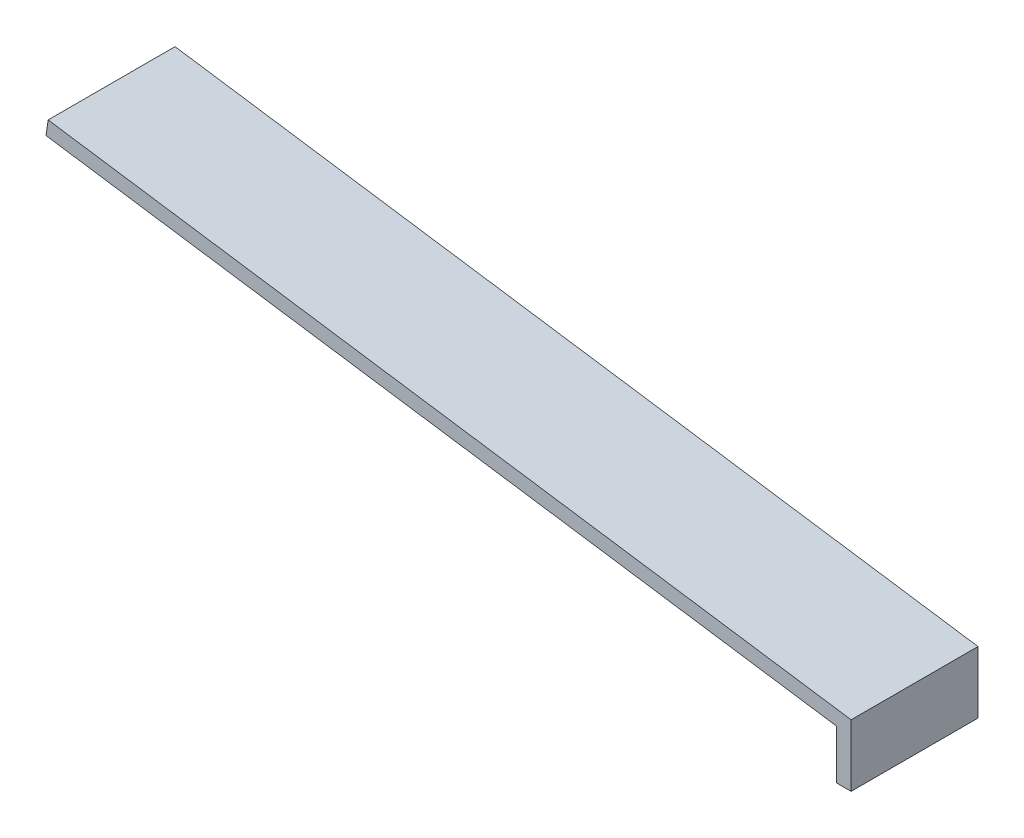
ISO-10303-21;
HEADER;
FILE_DESCRIPTION(('STEP AP214'),'2;1');
FILE_NAME('part.step','',(''),(''),'','','');
FILE_SCHEMA(('AUTOMOTIVE_DESIGN { 1 0 10303 214 1 1 1 1 }'));
ENDSEC;
DATA;
#1=APPLICATION_CONTEXT('core data for automotive mechanical design processes');
#2=APPLICATION_PROTOCOL_DEFINITION('international standard','automotive_design',2000,#1);
#3=PRODUCT_CONTEXT('',#1,'mechanical');
#4=PRODUCT('Part','Part','',(#3));
#5=PRODUCT_RELATED_PRODUCT_CATEGORY('part','',(#4));
#6=PRODUCT_DEFINITION_FORMATION('','',#4);
#7=PRODUCT_DEFINITION_CONTEXT('part definition',#1,'design');
#8=PRODUCT_DEFINITION('design','',#6,#7);
#9=PRODUCT_DEFINITION_SHAPE('','',#8);
#10=(LENGTH_UNIT() NAMED_UNIT(*) SI_UNIT(.MILLI.,.METRE.));
#11=(NAMED_UNIT(*) PLANE_ANGLE_UNIT() SI_UNIT($,.RADIAN.));
#12=(NAMED_UNIT(*) SI_UNIT($,.STERADIAN.) SOLID_ANGLE_UNIT());
#13=UNCERTAINTY_MEASURE_WITH_UNIT(LENGTH_MEASURE(1.E-05),#10,'distance_accuracy_value','');
#14=(GEOMETRIC_REPRESENTATION_CONTEXT(3) GLOBAL_UNCERTAINTY_ASSIGNED_CONTEXT((#13)) GLOBAL_UNIT_ASSIGNED_CONTEXT((#10,
#11,#12)) REPRESENTATION_CONTEXT('',''));
#15=CARTESIAN_POINT('',(0.,0.,0.));
#16=DIRECTION('',(0.,0.,1.));
#17=DIRECTION('',(1.,0.,0.));
#18=AXIS2_PLACEMENT_3D('',#15,#16,#17);
#19=CARTESIAN_POINT('',(0.5,0.,2.15));
#20=DIRECTION('',(-1.,0.,0.));
#21=DIRECTION('',(0.,-1.,0.));
#22=AXIS2_PLACEMENT_3D('',#19,#20,#21);
#23=PLANE('',#22);
#24=DIRECTION('',(0.,1.,0.));
#25=VECTOR('',#24,1.);
#26=CARTESIAN_POINT('',(0.5,0.,-2.15));
#27=LINE('',#26,#25);
#28=CARTESIAN_POINT('',(0.5,0.,-2.15));
#29=VERTEX_POINT('',#28);
#30=CARTESIAN_POINT('',(0.5,2.1,-2.15));
#31=VERTEX_POINT('',#30);
#32=EDGE_CURVE('E72',#29,#31,#27,.T.);
#33=ORIENTED_EDGE('',*,*,#32,.T.);
#34=DIRECTION('',(0.,0.,-1.));
#35=VECTOR('',#34,1.);
#36=CARTESIAN_POINT('',(0.5,2.1,2.15));
#37=LINE('',#36,#35);
#38=CARTESIAN_POINT('',(0.5,2.1,2.15));
#39=VERTEX_POINT('',#38);
#40=EDGE_CURVE('E11',#39,#31,#37,.T.);
#41=ORIENTED_EDGE('',*,*,#40,.F.);
#42=DIRECTION('',(0.,1.,0.));
#43=VECTOR('',#42,1.);
#44=CARTESIAN_POINT('',(0.5,0.,2.15));
#45=LINE('',#44,#43);
#46=CARTESIAN_POINT('',(0.5,0.,2.15));
#47=VERTEX_POINT('',#46);
#48=EDGE_CURVE('E95',#47,#39,#45,.T.);
#49=ORIENTED_EDGE('',*,*,#48,.F.);
#50=DIRECTION('',(0.,0.,-1.));
#51=VECTOR('',#50,1.);
#52=CARTESIAN_POINT('',(0.5,0.,2.15));
#53=LINE('',#52,#51);
#54=EDGE_CURVE('E85',#47,#29,#53,.T.);
#55=ORIENTED_EDGE('',*,*,#54,.T.);
#56=EDGE_LOOP('',(#33,#41,#49,#55));
#57=FACE_BOUND('',#56,.T.);
#58=ADVANCED_FACE('F16',(#57),#23,.F.);
#59=CARTESIAN_POINT('',(0.5,2.1,2.15));
#60=DIRECTION('',(-0.145454545454545,-0.989364935302748,0.));
#61=DIRECTION('',(0.989364935302748,-0.145454545454545,0.));
#62=AXIS2_PLACEMENT_3D('',#59,#60,#61);
#63=PLANE('',#62);
#64=DIRECTION('',(-0.989364935302748,0.145454545454545,0.));
#65=VECTOR('',#64,1.);
#66=CARTESIAN_POINT('',(0.5,2.1,-2.15));
#67=LINE('',#66,#65);
#68=CARTESIAN_POINT('',(-26.7075357208256,6.1,-2.15));
#69=VERTEX_POINT('',#68);
#70=EDGE_CURVE('E68',#31,#69,#67,.T.);
#71=ORIENTED_EDGE('',*,*,#70,.T.);
#72=DIRECTION('',(0.,0.,-1.));
#73=VECTOR('',#72,1.);
#74=CARTESIAN_POINT('',(-26.7075357208256,6.1,2.15));
#75=LINE('',#74,#73);
#76=CARTESIAN_POINT('',(-26.7075357208256,6.1,2.15));
#77=VERTEX_POINT('',#76);
#78=EDGE_CURVE('E23',#77,#69,#75,.T.);
#79=ORIENTED_EDGE('',*,*,#78,.F.);
#80=DIRECTION('',(-0.989364935302748,0.145454545454545,0.));
#81=VECTOR('',#80,1.);
#82=CARTESIAN_POINT('',(0.5,2.1,2.15));
#83=LINE('',#82,#81);
#84=EDGE_CURVE('E81',#39,#77,#83,.T.);
#85=ORIENTED_EDGE('',*,*,#84,.F.);
#86=ORIENTED_EDGE('',*,*,#40,.T.);
#87=EDGE_LOOP('',(#71,#79,#85,#86));
#88=FACE_BOUND('',#87,.T.);
#89=ADVANCED_FACE('F80',(#88),#63,.F.);
#90=CARTESIAN_POINT('',(-26.7075357208256,6.1,2.15));
#91=DIRECTION('',(0.989364935302748,-0.145454545454546,0.));
#92=DIRECTION('',(0.145454545454546,0.989364935302748,0.));
#93=AXIS2_PLACEMENT_3D('',#90,#91,#92);
#94=PLANE('',#93);
#95=DIRECTION('',(-0.145454545454546,-0.989364935302748,0.));
#96=VECTOR('',#95,1.);
#97=CARTESIAN_POINT('',(-26.7075357208256,6.1,-2.15));
#98=LINE('',#97,#96);
#99=CARTESIAN_POINT('',(-26.7802629935528,5.60531753234863,-2.15));
#100=VERTEX_POINT('',#99);
#101=EDGE_CURVE('E74',#69,#100,#98,.T.);
#102=ORIENTED_EDGE('',*,*,#101,.T.);
#103=DIRECTION('',(0.,0.,-1.));
#104=VECTOR('',#103,1.);
#105=CARTESIAN_POINT('',(-26.7802629935528,5.60531753234863,2.15));
#106=LINE('',#105,#104);
#107=CARTESIAN_POINT('',(-26.7802629935528,5.60531753234863,2.15));
#108=VERTEX_POINT('',#107);
#109=EDGE_CURVE('E111',#108,#100,#106,.T.);
#110=ORIENTED_EDGE('',*,*,#109,.F.);
#111=DIRECTION('',(-0.145454545454546,-0.989364935302748,0.));
#112=VECTOR('',#111,1.);
#113=CARTESIAN_POINT('',(-26.7075357208256,6.1,2.15));
#114=LINE('',#113,#112);
#115=EDGE_CURVE('E98',#77,#108,#114,.T.);
#116=ORIENTED_EDGE('',*,*,#115,.F.);
#117=ORIENTED_EDGE('',*,*,#78,.T.);
#118=EDGE_LOOP('',(#102,#110,#116,#117));
#119=FACE_BOUND('',#118,.T.);
#120=ADVANCED_FACE('F115',(#119),#94,.F.);
#121=CARTESIAN_POINT('',(-26.7802629935528,5.60531753234863,2.15));
#122=DIRECTION('',(0.145454545454545,0.989364935302748,0.));
#123=DIRECTION('',(-0.989364935302748,0.145454545454545,0.));
#124=AXIS2_PLACEMENT_3D('',#121,#122,#123);
#125=PLANE('',#124);
#126=DIRECTION('',(0.989364935302748,-0.145454545454545,0.));
#127=VECTOR('',#126,1.);
#128=CARTESIAN_POINT('',(-26.7802629935528,5.60531753234863,-2.15));
#129=LINE('',#128,#127);
#130=CARTESIAN_POINT('',(0.,1.66813435363769,-2.15));
#131=VERTEX_POINT('',#130);
#132=EDGE_CURVE('E89',#100,#131,#129,.T.);
#133=ORIENTED_EDGE('',*,*,#132,.T.);
#134=DIRECTION('',(0.,0.,-1.));
#135=VECTOR('',#134,1.);
#136=CARTESIAN_POINT('',(0.,1.66813435363769,2.15));
#137=LINE('',#136,#135);
#138=CARTESIAN_POINT('',(0.,1.66813435363769,2.15));
#139=VERTEX_POINT('',#138);
#140=EDGE_CURVE('E108',#139,#131,#137,.T.);
#141=ORIENTED_EDGE('',*,*,#140,.F.);
#142=DIRECTION('',(0.989364935302748,-0.145454545454545,0.));
#143=VECTOR('',#142,1.);
#144=CARTESIAN_POINT('',(-26.7802629935528,5.60531753234863,2.15));
#145=LINE('',#144,#143);
#146=EDGE_CURVE('E100',#108,#139,#145,.T.);
#147=ORIENTED_EDGE('',*,*,#146,.F.);
#148=ORIENTED_EDGE('',*,*,#109,.T.);
#149=EDGE_LOOP('',(#133,#141,#147,#148));
#150=FACE_BOUND('',#149,.T.);
#151=ADVANCED_FACE('F121',(#150),#125,.F.);
#152=CARTESIAN_POINT('',(0.,1.66813435363769,2.15));
#153=DIRECTION('',(1.,0.,0.));
#154=DIRECTION('',(0.,1.,0.));
#155=AXIS2_PLACEMENT_3D('',#152,#153,#154);
#156=PLANE('',#155);
#157=DIRECTION('',(0.,-1.,0.));
#158=VECTOR('',#157,1.);
#159=CARTESIAN_POINT('',(0.,1.66813435363769,-2.15));
#160=LINE('',#159,#158);
#161=CARTESIAN_POINT('',(0.,0.,-2.15));
#162=VERTEX_POINT('',#161);
#163=EDGE_CURVE('E91',#131,#162,#160,.T.);
#164=ORIENTED_EDGE('',*,*,#163,.T.);
#165=DIRECTION('',(0.,0.,-1.));
#166=VECTOR('',#165,1.);
#167=CARTESIAN_POINT('',(0.,0.,2.15));
#168=LINE('',#167,#166);
#169=CARTESIAN_POINT('',(0.,0.,2.15));
#170=VERTEX_POINT('',#169);
#171=EDGE_CURVE('E105',#170,#162,#168,.T.);
#172=ORIENTED_EDGE('',*,*,#171,.F.);
#173=DIRECTION('',(0.,-1.,0.));
#174=VECTOR('',#173,1.);
#175=CARTESIAN_POINT('',(0.,1.66813435363769,2.15));
#176=LINE('',#175,#174);
#177=EDGE_CURVE('E35',#139,#170,#176,.T.);
#178=ORIENTED_EDGE('',*,*,#177,.F.);
#179=ORIENTED_EDGE('',*,*,#140,.T.);
#180=EDGE_LOOP('',(#164,#172,#178,#179));
#181=FACE_BOUND('',#180,.T.);
#182=ADVANCED_FACE('F124',(#181),#156,.F.);
#183=CARTESIAN_POINT('',(0.,0.,2.15));
#184=DIRECTION('',(0.,1.,0.));
#185=DIRECTION('',(0.,0.,1.));
#186=AXIS2_PLACEMENT_3D('',#183,#184,#185);
#187=PLANE('',#186);
#188=DIRECTION('',(1.,0.,0.));
#189=VECTOR('',#188,1.);
#190=CARTESIAN_POINT('',(0.,0.,-2.15));
#191=LINE('',#190,#189);
#192=EDGE_CURVE('E93',#162,#29,#191,.T.);
#193=ORIENTED_EDGE('',*,*,#192,.T.);
#194=ORIENTED_EDGE('',*,*,#54,.F.);
#195=DIRECTION('',(1.,0.,0.));
#196=VECTOR('',#195,1.);
#197=CARTESIAN_POINT('',(0.,0.,2.15));
#198=LINE('',#197,#196);
#199=EDGE_CURVE('E30',#170,#47,#198,.T.);
#200=ORIENTED_EDGE('',*,*,#199,.F.);
#201=ORIENTED_EDGE('',*,*,#171,.T.);
#202=EDGE_LOOP('',(#193,#194,#200,#201));
#203=FACE_BOUND('',#202,.T.);
#204=ADVANCED_FACE('F126',(#203),#187,.F.);
#205=CARTESIAN_POINT('',(0.5,0.,2.15));
#206=DIRECTION('',(0.,0.,-1.));
#207=DIRECTION('',(-1.,0.,0.));
#208=AXIS2_PLACEMENT_3D('',#205,#206,#207);
#209=PLANE('',#208);
#210=ORIENTED_EDGE('',*,*,#48,.T.);
#211=ORIENTED_EDGE('',*,*,#84,.T.);
#212=ORIENTED_EDGE('',*,*,#115,.T.);
#213=ORIENTED_EDGE('',*,*,#146,.T.);
#214=ORIENTED_EDGE('',*,*,#177,.T.);
#215=ORIENTED_EDGE('',*,*,#199,.T.);
#216=EDGE_LOOP('',(#210,#211,#212,#213,#214,#215));
#217=FACE_BOUND('',#216,.T.);
#218=ADVANCED_FACE('F118',(#217),#209,.F.);
#219=CARTESIAN_POINT('',(0.5,0.,-2.15));
#220=DIRECTION('',(0.,0.,-1.));
#221=DIRECTION('',(-1.,0.,0.));
#222=AXIS2_PLACEMENT_3D('',#219,#220,#221);
#223=PLANE('',#222);
#224=ORIENTED_EDGE('',*,*,#32,.F.);
#225=ORIENTED_EDGE('',*,*,#192,.F.);
#226=ORIENTED_EDGE('',*,*,#163,.F.);
#227=ORIENTED_EDGE('',*,*,#132,.F.);
#228=ORIENTED_EDGE('',*,*,#101,.F.);
#229=ORIENTED_EDGE('',*,*,#70,.F.);
#230=EDGE_LOOP('',(#224,#225,#226,#227,#228,#229));
#231=FACE_BOUND('',#230,.T.);
#232=ADVANCED_FACE('F69',(#231),#223,.T.);
#233=CLOSED_SHELL('',(#58,#89,#120,#151,#182,#204,#218,#232));
#234=MANIFOLD_SOLID_BREP('B1',#233);
#235=ADVANCED_BREP_SHAPE_REPRESENTATION('',(#18,#234),#14);
#236=SHAPE_DEFINITION_REPRESENTATION(#9,#235);
ENDSEC;
END-ISO-10303-21;
